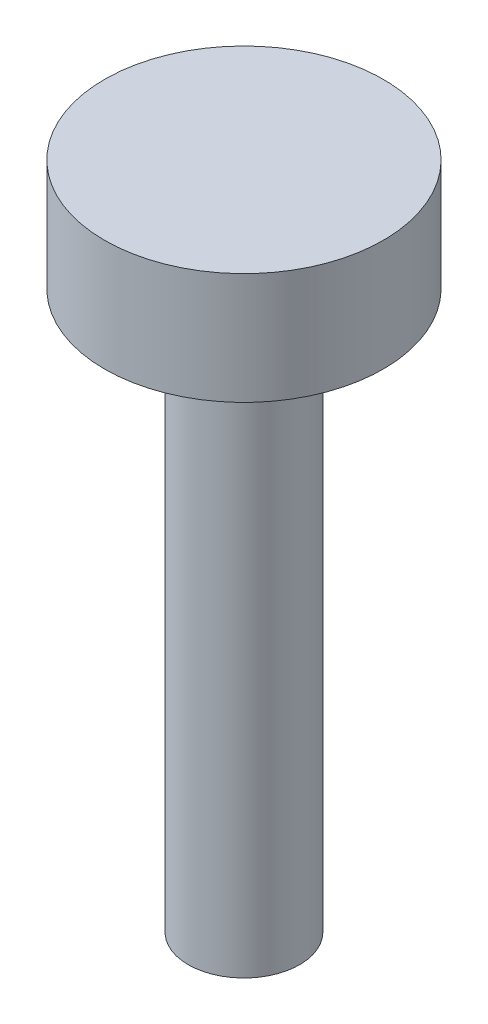
ISO-10303-21;
HEADER;
FILE_DESCRIPTION(('STEP AP214'),'2;1');
FILE_NAME('part.step','',(''),(''),'','','');
FILE_SCHEMA(('AUTOMOTIVE_DESIGN { 1 0 10303 214 1 1 1 1 }'));
ENDSEC;
DATA;
#1=APPLICATION_CONTEXT('core data for automotive mechanical design processes');
#2=APPLICATION_PROTOCOL_DEFINITION('international standard','automotive_design',2000,#1);
#3=PRODUCT_CONTEXT('',#1,'mechanical');
#4=PRODUCT('Part','Part','',(#3));
#5=PRODUCT_RELATED_PRODUCT_CATEGORY('part','',(#4));
#6=PRODUCT_DEFINITION_FORMATION('','',#4);
#7=PRODUCT_DEFINITION_CONTEXT('part definition',#1,'design');
#8=PRODUCT_DEFINITION('design','',#6,#7);
#9=PRODUCT_DEFINITION_SHAPE('','',#8);
#10=(LENGTH_UNIT() NAMED_UNIT(*) SI_UNIT(.MILLI.,.METRE.));
#11=(NAMED_UNIT(*) PLANE_ANGLE_UNIT() SI_UNIT($,.RADIAN.));
#12=(NAMED_UNIT(*) SI_UNIT($,.STERADIAN.) SOLID_ANGLE_UNIT());
#13=UNCERTAINTY_MEASURE_WITH_UNIT(LENGTH_MEASURE(1.E-05),#10,'distance_accuracy_value','');
#14=(GEOMETRIC_REPRESENTATION_CONTEXT(3) GLOBAL_UNCERTAINTY_ASSIGNED_CONTEXT((#13)) GLOBAL_UNIT_ASSIGNED_CONTEXT((#10,
#11,#12)) REPRESENTATION_CONTEXT('',''));
#15=CARTESIAN_POINT('',(0.,0.,0.));
#16=DIRECTION('',(0.,0.,1.));
#17=DIRECTION('',(1.,0.,0.));
#18=AXIS2_PLACEMENT_3D('',#15,#16,#17);
#19=CARTESIAN_POINT('',(0.,100.,0.));
#20=DIRECTION('',(0.,-1.,0.));
#21=DIRECTION('',(0.,0.,-1.));
#22=AXIS2_PLACEMENT_3D('',#19,#20,#21);
#23=CYLINDRICAL_SURFACE('',#22,10.);
#24=CARTESIAN_POINT('',(0.,100.,0.));
#25=DIRECTION('',(0.,1.,0.));
#26=DIRECTION('',(0.,0.,1.));
#27=AXIS2_PLACEMENT_3D('',#24,#25,#26);
#28=CIRCLE('',#27,10.);
#29=CARTESIAN_POINT('',(0.,100.,10.));
#30=VERTEX_POINT('',#29);
#31=EDGE_CURVE('E10',#30,#30,#28,.T.);
#32=ORIENTED_EDGE('',*,*,#31,.F.);
#33=EDGE_LOOP('',(#32));
#34=FACE_BOUND('',#33,.T.);
#35=CARTESIAN_POINT('',(0.,0.,0.));
#36=DIRECTION('',(0.,1.,0.));
#37=DIRECTION('',(0.,0.,1.));
#38=AXIS2_PLACEMENT_3D('',#35,#36,#37);
#39=CIRCLE('',#38,10.);
#40=CARTESIAN_POINT('',(0.,0.,10.));
#41=VERTEX_POINT('',#40);
#42=EDGE_CURVE('E34',#41,#41,#39,.T.);
#43=ORIENTED_EDGE('',*,*,#42,.T.);
#44=EDGE_LOOP('',(#43));
#45=FACE_BOUND('',#44,.T.);
#46=ADVANCED_FACE('F31',(#34,#45),#23,.T.);
#47=CARTESIAN_POINT('',(0.,0.,0.));
#48=DIRECTION('',(0.,1.,0.));
#49=DIRECTION('',(0.,0.,1.));
#50=AXIS2_PLACEMENT_3D('',#47,#48,#49);
#51=PLANE('',#50);
#52=ORIENTED_EDGE('',*,*,#42,.F.);
#53=EDGE_LOOP('',(#52));
#54=FACE_BOUND('',#53,.T.);
#55=ADVANCED_FACE('F54',(#54),#51,.F.);
#56=CARTESIAN_POINT('',(0.,120.,0.));
#57=DIRECTION('',(0.,-1.,0.));
#58=DIRECTION('',(0.,0.,-1.));
#59=AXIS2_PLACEMENT_3D('',#56,#57,#58);
#60=CYLINDRICAL_SURFACE('',#59,25.);
#61=CARTESIAN_POINT('',(0.,120.,0.));
#62=DIRECTION('',(0.,1.,0.));
#63=DIRECTION('',(0.,0.,1.));
#64=AXIS2_PLACEMENT_3D('',#61,#62,#63);
#65=CIRCLE('',#64,25.);
#66=CARTESIAN_POINT('',(0.,120.,25.));
#67=VERTEX_POINT('',#66);
#68=EDGE_CURVE('E41',#67,#67,#65,.T.);
#69=ORIENTED_EDGE('',*,*,#68,.F.);
#70=EDGE_LOOP('',(#69));
#71=FACE_BOUND('',#70,.T.);
#72=CARTESIAN_POINT('',(0.,100.,0.));
#73=DIRECTION('',(0.,1.,0.));
#74=DIRECTION('',(0.,0.,1.));
#75=AXIS2_PLACEMENT_3D('',#72,#73,#74);
#76=CIRCLE('',#75,25.);
#77=CARTESIAN_POINT('',(0.,100.,25.));
#78=VERTEX_POINT('',#77);
#79=EDGE_CURVE('E43',#78,#78,#76,.T.);
#80=ORIENTED_EDGE('',*,*,#79,.T.);
#81=EDGE_LOOP('',(#80));
#82=FACE_BOUND('',#81,.T.);
#83=ADVANCED_FACE('F51',(#71,#82),#60,.T.);
#84=CARTESIAN_POINT('',(0.,120.,0.));
#85=DIRECTION('',(0.,1.,0.));
#86=DIRECTION('',(0.,0.,1.));
#87=AXIS2_PLACEMENT_3D('',#84,#85,#86);
#88=PLANE('',#87);
#89=ORIENTED_EDGE('',*,*,#68,.T.);
#90=EDGE_LOOP('',(#89));
#91=FACE_BOUND('',#90,.T.);
#92=ADVANCED_FACE('F49',(#91),#88,.T.);
#93=CARTESIAN_POINT('',(0.,100.,0.));
#94=DIRECTION('',(0.,1.,0.));
#95=DIRECTION('',(0.,0.,1.));
#96=AXIS2_PLACEMENT_3D('',#93,#94,#95);
#97=PLANE('',#96);
#98=ORIENTED_EDGE('',*,*,#31,.T.);
#99=EDGE_LOOP('',(#98));
#100=FACE_BOUND('',#99,.T.);
#101=ORIENTED_EDGE('',*,*,#79,.F.);
#102=EDGE_LOOP('',(#101));
#103=FACE_BOUND('',#102,.T.);
#104=ADVANCED_FACE('F58',(#100,#103),#97,.F.);
#105=CLOSED_SHELL('',(#46,#55,#83,#92,#104));
#106=MANIFOLD_SOLID_BREP('B2',#105);
#107=ADVANCED_BREP_SHAPE_REPRESENTATION('',(#18,#106),#14);
#108=SHAPE_DEFINITION_REPRESENTATION(#9,#107);
ENDSEC;
END-ISO-10303-21;
